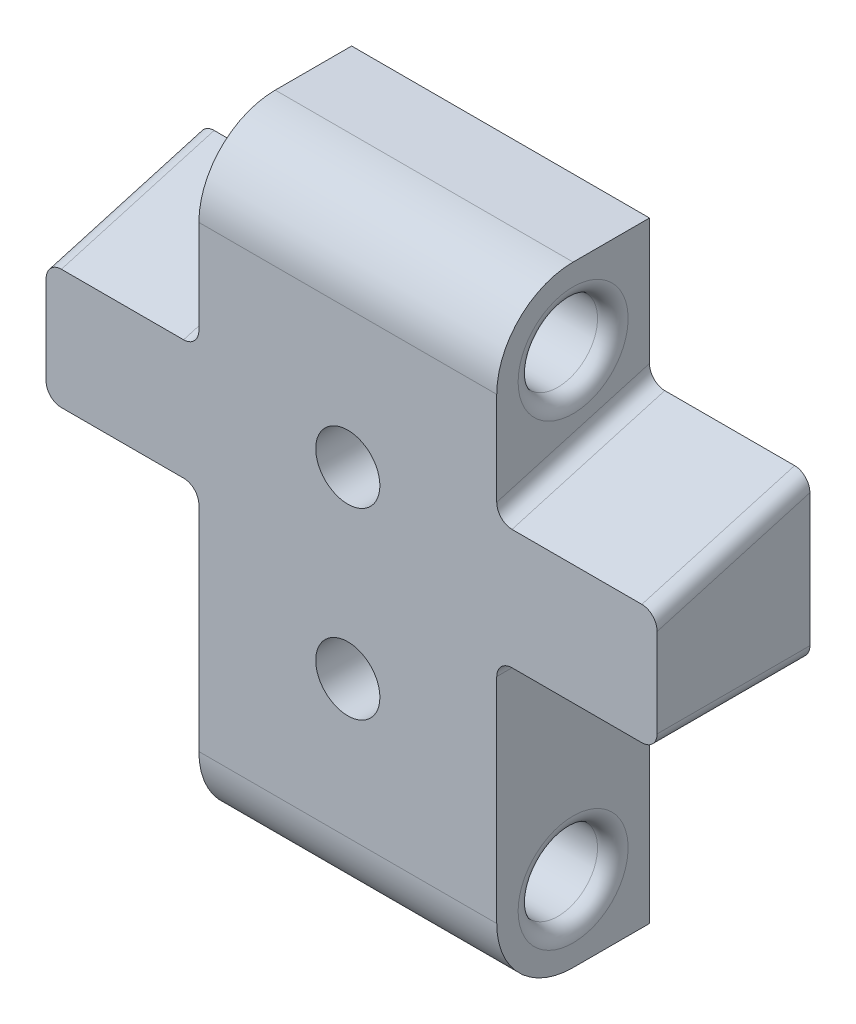
ISO-10303-21;
HEADER;
FILE_DESCRIPTION(('STEP AP214'),'2;1');
FILE_NAME('part.step','',(''),(''),'','','');
FILE_SCHEMA(('AUTOMOTIVE_DESIGN { 1 0 10303 214 1 1 1 1 }'));
ENDSEC;
DATA;
#1=APPLICATION_CONTEXT('core data for automotive mechanical design processes');
#2=APPLICATION_PROTOCOL_DEFINITION('international standard','automotive_design',2000,#1);
#3=PRODUCT_CONTEXT('',#1,'mechanical');
#4=PRODUCT('Part','Part','',(#3));
#5=PRODUCT_RELATED_PRODUCT_CATEGORY('part','',(#4));
#6=PRODUCT_DEFINITION_FORMATION('','',#4);
#7=PRODUCT_DEFINITION_CONTEXT('part definition',#1,'design');
#8=PRODUCT_DEFINITION('design','',#6,#7);
#9=PRODUCT_DEFINITION_SHAPE('','',#8);
#10=(LENGTH_UNIT() NAMED_UNIT(*) SI_UNIT(.MILLI.,.METRE.));
#11=(NAMED_UNIT(*) PLANE_ANGLE_UNIT() SI_UNIT($,.RADIAN.));
#12=(NAMED_UNIT(*) SI_UNIT($,.STERADIAN.) SOLID_ANGLE_UNIT());
#13=UNCERTAINTY_MEASURE_WITH_UNIT(LENGTH_MEASURE(1.E-05),#10,'distance_accuracy_value','');
#14=(GEOMETRIC_REPRESENTATION_CONTEXT(3) GLOBAL_UNCERTAINTY_ASSIGNED_CONTEXT((#13)) GLOBAL_UNIT_ASSIGNED_CONTEXT((#10,
#11,#12)) REPRESENTATION_CONTEXT('',''));
#15=CARTESIAN_POINT('',(0.,0.,0.));
#16=DIRECTION('',(0.,0.,1.));
#17=DIRECTION('',(1.,0.,0.));
#18=AXIS2_PLACEMENT_3D('',#15,#16,#17);
#19=CARTESIAN_POINT('',(-120.5,0.,0.));
#20=DIRECTION('',(-1.,0.,0.));
#21=DIRECTION('',(0.,0.,1.));
#22=AXIS2_PLACEMENT_3D('',#19,#20,#21);
#23=PLANE('',#22);
#24=CARTESIAN_POINT('',(-120.5,18.5,50.));
#25=DIRECTION('',(-1.,0.,0.));
#26=DIRECTION('',(0.,0.,1.));
#27=AXIS2_PLACEMENT_3D('',#24,#25,#26);
#28=CIRCLE('',#27,3.6);
#29=CARTESIAN_POINT('',(-120.5,18.5,53.6));
#30=VERTEX_POINT('',#29);
#31=EDGE_CURVE('E256',#30,#30,#28,.T.);
#32=ORIENTED_EDGE('',*,*,#31,.T.);
#33=EDGE_LOOP('',(#32));
#34=FACE_BOUND('',#33,.T.);
#35=DIRECTION('',(0.,-1.,0.));
#36=VECTOR('',#35,1.);
#37=CARTESIAN_POINT('',(-120.5,0.,45.));
#38=LINE('',#37,#36);
#39=CARTESIAN_POINT('',(-120.5,32.5,45.));
#40=VERTEX_POINT('',#39);
#41=CARTESIAN_POINT('',(-120.5,13.5,45.));
#42=VERTEX_POINT('',#41);
#43=EDGE_CURVE('E211',#40,#42,#38,.T.);
#44=ORIENTED_EDGE('',*,*,#43,.F.);
#45=DIRECTION('',(0.,0.,-1.));
#46=VECTOR('',#45,1.);
#47=CARTESIAN_POINT('',(-120.5,32.5,55.));
#48=LINE('',#47,#46);
#49=CARTESIAN_POINT('',(-120.5,32.5,55.));
#50=VERTEX_POINT('',#49);
#51=EDGE_CURVE('E259',#40,#50,#48,.F.);
#52=ORIENTED_EDGE('',*,*,#51,.T.);
#53=DIRECTION('',(0.,-1.,0.));
#54=VECTOR('',#53,1.);
#55=CARTESIAN_POINT('',(-120.5,0.,55.));
#56=LINE('',#55,#54);
#57=CARTESIAN_POINT('',(-120.5,18.5,55.));
#58=VERTEX_POINT('',#57);
#59=EDGE_CURVE('E203',#50,#58,#56,.T.);
#60=ORIENTED_EDGE('',*,*,#59,.T.);
#61=CARTESIAN_POINT('',(-120.5,18.5,50.));
#62=DIRECTION('',(-1.,0.,0.));
#63=DIRECTION('',(0.,0.,1.));
#64=AXIS2_PLACEMENT_3D('',#61,#62,#63);
#65=CIRCLE('',#64,5.);
#66=CARTESIAN_POINT('',(-120.5,13.5,50.));
#67=VERTEX_POINT('',#66);
#68=EDGE_CURVE('E193',#67,#58,#65,.T.);
#69=ORIENTED_EDGE('',*,*,#68,.F.);
#70=DIRECTION('',(0.,0.,1.));
#71=VECTOR('',#70,1.);
#72=CARTESIAN_POINT('',(-120.5,13.5,0.));
#73=LINE('',#72,#71);
#74=EDGE_CURVE('E218',#42,#67,#73,.T.);
#75=ORIENTED_EDGE('',*,*,#74,.F.);
#76=EDGE_LOOP('',(#44,#52,#60,#69,#75));
#77=FACE_BOUND('',#76,.T.);
#78=ADVANCED_FACE('F34',(#34,#77),#23,.F.);
#79=CARTESIAN_POINT('',(-120.5,48.5,50.));
#80=DIRECTION('',(-1.,0.,0.));
#81=DIRECTION('',(0.,0.,1.));
#82=AXIS2_PLACEMENT_3D('',#79,#80,#81);
#83=CIRCLE('',#82,3.6);
#84=CARTESIAN_POINT('',(-120.5,48.5,53.6));
#85=VERTEX_POINT('',#84);
#86=EDGE_CURVE('E293',#85,#85,#83,.T.);
#87=ORIENTED_EDGE('',*,*,#86,.T.);
#88=EDGE_LOOP('',(#87));
#89=FACE_BOUND('',#88,.T.);
#90=CARTESIAN_POINT('',(-120.5,48.5,55.));
#91=VERTEX_POINT('',#90);
#92=CARTESIAN_POINT('',(-120.5,42.3849256098288,55.));
#93=VERTEX_POINT('',#92);
#94=EDGE_CURVE('E196',#91,#93,#56,.T.);
#95=ORIENTED_EDGE('',*,*,#94,.T.);
#96=DIRECTION('',(0.,-0.275637355817,0.961261695938319));
#97=VECTOR('',#96,1.);
#98=CARTESIAN_POINT('',(-120.5,45.1733417274936,45.275637355817));
#99=LINE('',#98,#97);
#100=CARTESIAN_POINT('',(-120.5,45.2523794674169,45.));
#101=VERTEX_POINT('',#100);
#102=EDGE_CURVE('E296',#93,#101,#99,.F.);
#103=ORIENTED_EDGE('',*,*,#102,.T.);
#104=CARTESIAN_POINT('',(-120.5,53.5,45.));
#105=VERTEX_POINT('',#104);
#106=EDGE_CURVE('E215',#105,#101,#38,.T.);
#107=ORIENTED_EDGE('',*,*,#106,.F.);
#108=DIRECTION('',(0.,0.,1.));
#109=VECTOR('',#108,1.);
#110=CARTESIAN_POINT('',(-120.5,53.5,0.));
#111=LINE('',#110,#109);
#112=CARTESIAN_POINT('',(-120.5,53.5,50.));
#113=VERTEX_POINT('',#112);
#114=EDGE_CURVE('E208',#105,#113,#111,.T.);
#115=ORIENTED_EDGE('',*,*,#114,.T.);
#116=CARTESIAN_POINT('',(-120.5,48.5,50.));
#117=DIRECTION('',(-1.,0.,0.));
#118=DIRECTION('',(0.,0.,1.));
#119=AXIS2_PLACEMENT_3D('',#116,#117,#118);
#120=CIRCLE('',#119,5.);
#121=EDGE_CURVE('E187',#91,#113,#120,.T.);
#122=ORIENTED_EDGE('',*,*,#121,.F.);
#123=EDGE_LOOP('',(#95,#103,#107,#115,#122));
#124=FACE_BOUND('',#123,.T.);
#125=ADVANCED_FACE('F205',(#89,#124),#23,.F.);
#126=CARTESIAN_POINT('',(-140.,0.,0.));
#127=DIRECTION('',(-1.,0.,0.));
#128=DIRECTION('',(0.,0.,1.));
#129=AXIS2_PLACEMENT_3D('',#126,#127,#128);
#130=PLANE('',#129);
#131=CARTESIAN_POINT('',(-140.,18.5,50.));
#132=DIRECTION('',(-1.,0.,0.));
#133=DIRECTION('',(0.,0.,1.));
#134=AXIS2_PLACEMENT_3D('',#131,#132,#133);
#135=CIRCLE('',#134,3.6);
#136=CARTESIAN_POINT('',(-140.,18.5,53.6));
#137=VERTEX_POINT('',#136);
#138=EDGE_CURVE('E313',#137,#137,#135,.F.);
#139=ORIENTED_EDGE('',*,*,#138,.T.);
#140=EDGE_LOOP('',(#139));
#141=FACE_BOUND('',#140,.T.);
#142=DIRECTION('',(0.,-1.,0.));
#143=VECTOR('',#142,1.);
#144=CARTESIAN_POINT('',(-140.,0.,55.));
#145=LINE('',#144,#143);
#146=CARTESIAN_POINT('',(-140.,32.5,55.));
#147=VERTEX_POINT('',#146);
#148=CARTESIAN_POINT('',(-140.,18.5,55.));
#149=VERTEX_POINT('',#148);
#150=EDGE_CURVE('E225',#147,#149,#145,.T.);
#151=ORIENTED_EDGE('',*,*,#150,.F.);
#152=DIRECTION('',(0.,0.,-1.));
#153=VECTOR('',#152,1.);
#154=CARTESIAN_POINT('',(-140.,32.5,0.));
#155=LINE('',#154,#153);
#156=CARTESIAN_POINT('',(-140.,32.5,45.));
#157=VERTEX_POINT('',#156);
#158=EDGE_CURVE('E310',#147,#157,#155,.T.);
#159=ORIENTED_EDGE('',*,*,#158,.T.);
#160=DIRECTION('',(0.,-1.,0.));
#161=VECTOR('',#160,1.);
#162=CARTESIAN_POINT('',(-140.,0.,45.));
#163=LINE('',#162,#161);
#164=CARTESIAN_POINT('',(-140.,13.5,45.));
#165=VERTEX_POINT('',#164);
#166=EDGE_CURVE('E230',#157,#165,#163,.T.);
#167=ORIENTED_EDGE('',*,*,#166,.T.);
#168=DIRECTION('',(0.,0.,1.));
#169=VECTOR('',#168,1.);
#170=CARTESIAN_POINT('',(-140.,13.5,0.));
#171=LINE('',#170,#169);
#172=CARTESIAN_POINT('',(-140.,13.5,50.));
#173=VERTEX_POINT('',#172);
#174=EDGE_CURVE('E234',#165,#173,#171,.T.);
#175=ORIENTED_EDGE('',*,*,#174,.T.);
#176=CARTESIAN_POINT('',(-140.,18.5,50.));
#177=DIRECTION('',(-1.,0.,0.));
#178=DIRECTION('',(0.,0.,1.));
#179=AXIS2_PLACEMENT_3D('',#176,#177,#178);
#180=CIRCLE('',#179,5.);
#181=EDGE_CURVE('E237',#173,#149,#180,.T.);
#182=ORIENTED_EDGE('',*,*,#181,.T.);
#183=EDGE_LOOP('',(#151,#159,#167,#175,#182));
#184=FACE_BOUND('',#183,.T.);
#185=ADVANCED_FACE('F405',(#141,#184),#130,.T.);
#186=CARTESIAN_POINT('',(-140.,48.5,50.));
#187=DIRECTION('',(-1.,0.,0.));
#188=DIRECTION('',(0.,0.,1.));
#189=AXIS2_PLACEMENT_3D('',#186,#187,#188);
#190=CIRCLE('',#189,3.6);
#191=CARTESIAN_POINT('',(-140.,48.5,53.6));
#192=VERTEX_POINT('',#191);
#193=EDGE_CURVE('E307',#192,#192,#190,.F.);
#194=ORIENTED_EDGE('',*,*,#193,.T.);
#195=EDGE_LOOP('',(#194));
#196=FACE_BOUND('',#195,.T.);
#197=CARTESIAN_POINT('',(-140.,53.5,45.));
#198=VERTEX_POINT('',#197);
#199=CARTESIAN_POINT('',(-140.,45.2523794674169,45.));
#200=VERTEX_POINT('',#199);
#201=EDGE_CURVE('E231',#198,#200,#163,.T.);
#202=ORIENTED_EDGE('',*,*,#201,.T.);
#203=DIRECTION('',(0.,-0.275637355817,0.961261695938319));
#204=VECTOR('',#203,1.);
#205=CARTESIAN_POINT('',(-140.,53.737470305901,15.4089716525681));
#206=LINE('',#205,#204);
#207=CARTESIAN_POINT('',(-140.,42.3849256098288,55.));
#208=VERTEX_POINT('',#207);
#209=EDGE_CURVE('E304',#200,#208,#206,.T.);
#210=ORIENTED_EDGE('',*,*,#209,.T.);
#211=CARTESIAN_POINT('',(-140.,48.5,55.));
#212=VERTEX_POINT('',#211);
#213=EDGE_CURVE('E223',#212,#208,#145,.T.);
#214=ORIENTED_EDGE('',*,*,#213,.F.);
#215=CARTESIAN_POINT('',(-140.,48.5,50.));
#216=DIRECTION('',(-1.,0.,0.));
#217=DIRECTION('',(0.,0.,1.));
#218=AXIS2_PLACEMENT_3D('',#215,#216,#217);
#219=CIRCLE('',#218,5.);
#220=CARTESIAN_POINT('',(-140.,53.5,50.));
#221=VERTEX_POINT('',#220);
#222=EDGE_CURVE('E189',#212,#221,#219,.T.);
#223=ORIENTED_EDGE('',*,*,#222,.T.);
#224=DIRECTION('',(0.,0.,1.));
#225=VECTOR('',#224,1.);
#226=CARTESIAN_POINT('',(-140.,53.5,0.));
#227=LINE('',#226,#225);
#228=EDGE_CURVE('E227',#198,#221,#227,.T.);
#229=ORIENTED_EDGE('',*,*,#228,.F.);
#230=EDGE_LOOP('',(#202,#210,#214,#223,#229));
#231=FACE_BOUND('',#230,.T.);
#232=ADVANCED_FACE('F362',(#196,#231),#130,.T.);
#233=CARTESIAN_POINT('',(-120.5,0.,55.));
#234=DIRECTION('',(0.,0.,-1.));
#235=DIRECTION('',(-1.,0.,0.));
#236=AXIS2_PLACEMENT_3D('',#233,#234,#235);
#237=PLANE('',#236);
#238=CARTESIAN_POINT('',(-130.25,27.5,55.));
#239=DIRECTION('',(0.,0.,1.));
#240=DIRECTION('',(1.,0.,0.));
#241=AXIS2_PLACEMENT_3D('',#238,#239,#240);
#242=CIRCLE('',#241,2.09999999999999);
#243=CARTESIAN_POINT('',(-128.15,27.5,55.));
#244=VERTEX_POINT('',#243);
#245=EDGE_CURVE('E539',#244,#244,#242,.T.);
#246=ORIENTED_EDGE('',*,*,#245,.F.);
#247=EDGE_LOOP('',(#246));
#248=FACE_BOUND('',#247,.T.);
#249=CARTESIAN_POINT('',(-130.25,39.5,55.));
#250=DIRECTION('',(0.,0.,1.));
#251=DIRECTION('',(1.,0.,0.));
#252=AXIS2_PLACEMENT_3D('',#249,#250,#251);
#253=CIRCLE('',#252,2.10000000000002);
#254=CARTESIAN_POINT('',(-128.15,39.5,55.));
#255=VERTEX_POINT('',#254);
#256=EDGE_CURVE('E533',#255,#255,#253,.T.);
#257=ORIENTED_EDGE('',*,*,#256,.F.);
#258=EDGE_LOOP('',(#257));
#259=FACE_BOUND('',#258,.T.);
#260=DIRECTION('',(-1.,0.,0.));
#261=VECTOR('',#260,1.);
#262=CARTESIAN_POINT('',(-110.,33.5,55.));
#263=LINE('',#262,#261);
#264=CARTESIAN_POINT('',(-111.,33.5,55.));
#265=VERTEX_POINT('',#264);
#266=CARTESIAN_POINT('',(-119.5,33.5,55.));
#267=VERTEX_POINT('',#266);
#268=EDGE_CURVE('E351',#265,#267,#263,.T.);
#269=ORIENTED_EDGE('',*,*,#268,.F.);
#270=CARTESIAN_POINT('',(-111.,34.5,55.));
#271=DIRECTION('',(0.,0.,-1.));
#272=DIRECTION('',(-1.,0.,0.));
#273=AXIS2_PLACEMENT_3D('',#270,#271,#272);
#274=CIRCLE('',#273,1.);
#275=CARTESIAN_POINT('',(-110.,34.5,55.));
#276=VERTEX_POINT('',#275);
#277=EDGE_CURVE('E286',#265,#276,#274,.F.);
#278=ORIENTED_EDGE('',*,*,#277,.T.);
#279=DIRECTION('',(0.,-1.,0.));
#280=VECTOR('',#279,1.);
#281=CARTESIAN_POINT('',(-110.,0.,55.));
#282=LINE('',#281,#280);
#283=CARTESIAN_POINT('',(-110.,40.3043267381056,55.));
#284=VERTEX_POINT('',#283);
#285=EDGE_CURVE('E384',#284,#276,#282,.T.);
#286=ORIENTED_EDGE('',*,*,#285,.F.);
#287=CARTESIAN_POINT('',(-111.,40.3043267381056,55.));
#288=DIRECTION('',(0.,0.,-1.));
#289=DIRECTION('',(0.,-1.,0.));
#290=AXIS2_PLACEMENT_3D('',#287,#288,#289);
#291=ELLIPSE('',#290,1.0402994358616,1.);
#292=CARTESIAN_POINT('',(-111.,41.3446261739672,55.));
#293=VERTEX_POINT('',#292);
#294=EDGE_CURVE('E284',#284,#293,#291,.F.);
#295=ORIENTED_EDGE('',*,*,#294,.T.);
#296=DIRECTION('',(-1.,0.,0.));
#297=VECTOR('',#296,1.);
#298=CARTESIAN_POINT('',(-110.,41.3446261739672,55.));
#299=LINE('',#298,#297);
#300=CARTESIAN_POINT('',(-119.5,41.3446261739672,55.));
#301=VERTEX_POINT('',#300);
#302=EDGE_CURVE('E350',#293,#301,#299,.T.);
#303=ORIENTED_EDGE('',*,*,#302,.T.);
#304=CARTESIAN_POINT('',(-119.5,42.3849256098288,55.));
#305=DIRECTION('',(0.,0.,-1.));
#306=DIRECTION('',(0.,1.,0.));
#307=AXIS2_PLACEMENT_3D('',#304,#305,#306);
#308=ELLIPSE('',#307,1.0402994358616,1.);
#309=EDGE_CURVE('E200',#301,#93,#308,.T.);
#310=ORIENTED_EDGE('',*,*,#309,.T.);
#311=ORIENTED_EDGE('',*,*,#94,.F.);
#312=DIRECTION('',(-1.,0.,0.));
#313=VECTOR('',#312,1.);
#314=CARTESIAN_POINT('',(-120.5,48.5,55.));
#315=LINE('',#314,#313);
#316=EDGE_CURVE('E183',#91,#212,#315,.T.);
#317=ORIENTED_EDGE('',*,*,#316,.T.);
#318=ORIENTED_EDGE('',*,*,#213,.T.);
#319=CARTESIAN_POINT('',(-141.,42.3849256098288,55.));
#320=DIRECTION('',(0.,0.,-1.));
#321=DIRECTION('',(0.,-1.,0.));
#322=AXIS2_PLACEMENT_3D('',#319,#320,#321);
#323=ELLIPSE('',#322,1.0402994358616,1.);
#324=CARTESIAN_POINT('',(-141.,41.3446261739672,55.));
#325=VERTEX_POINT('',#324);
#326=EDGE_CURVE('E42',#208,#325,#323,.T.);
#327=ORIENTED_EDGE('',*,*,#326,.T.);
#328=CARTESIAN_POINT('',(-149.,41.3446261739672,55.));
#329=VERTEX_POINT('',#328);
#330=EDGE_CURVE('E341',#325,#329,#299,.T.);
#331=ORIENTED_EDGE('',*,*,#330,.T.);
#332=CARTESIAN_POINT('',(-149.,40.3043267381056,55.));
#333=DIRECTION('',(0.,0.,-1.));
#334=DIRECTION('',(0.,1.,0.));
#335=AXIS2_PLACEMENT_3D('',#332,#333,#334);
#336=ELLIPSE('',#335,1.0402994358616,1.);
#337=CARTESIAN_POINT('',(-150.,40.3043267381056,55.));
#338=VERTEX_POINT('',#337);
#339=EDGE_CURVE('E281',#329,#338,#336,.F.);
#340=ORIENTED_EDGE('',*,*,#339,.T.);
#341=DIRECTION('',(0.,-1.,0.));
#342=VECTOR('',#341,1.);
#343=CARTESIAN_POINT('',(-150.,0.,55.));
#344=LINE('',#343,#342);
#345=CARTESIAN_POINT('',(-150.,34.5,55.));
#346=VERTEX_POINT('',#345);
#347=EDGE_CURVE('E529',#338,#346,#344,.T.);
#348=ORIENTED_EDGE('',*,*,#347,.T.);
#349=CARTESIAN_POINT('',(-149.,34.5,55.));
#350=DIRECTION('',(0.,0.,-1.));
#351=DIRECTION('',(-1.,0.,0.));
#352=AXIS2_PLACEMENT_3D('',#349,#350,#351);
#353=CIRCLE('',#352,1.);
#354=CARTESIAN_POINT('',(-149.,33.5,55.));
#355=VERTEX_POINT('',#354);
#356=EDGE_CURVE('E55',#346,#355,#353,.F.);
#357=ORIENTED_EDGE('',*,*,#356,.T.);
#358=CARTESIAN_POINT('',(-141.,33.5,55.));
#359=VERTEX_POINT('',#358);
#360=EDGE_CURVE('E379',#359,#355,#263,.T.);
#361=ORIENTED_EDGE('',*,*,#360,.F.);
#362=CARTESIAN_POINT('',(-141.,32.5,55.));
#363=DIRECTION('',(0.,0.,-1.));
#364=DIRECTION('',(-1.,0.,0.));
#365=AXIS2_PLACEMENT_3D('',#362,#363,#364);
#366=CIRCLE('',#365,1.);
#367=EDGE_CURVE('E49',#359,#147,#366,.T.);
#368=ORIENTED_EDGE('',*,*,#367,.T.);
#369=ORIENTED_EDGE('',*,*,#150,.T.);
#370=DIRECTION('',(-1.,0.,0.));
#371=VECTOR('',#370,1.);
#372=CARTESIAN_POINT('',(-120.5,18.5,55.));
#373=LINE('',#372,#371);
#374=EDGE_CURVE('E240',#58,#149,#373,.T.);
#375=ORIENTED_EDGE('',*,*,#374,.F.);
#376=ORIENTED_EDGE('',*,*,#59,.F.);
#377=CARTESIAN_POINT('',(-119.5,32.5,55.));
#378=DIRECTION('',(0.,0.,-1.));
#379=DIRECTION('',(-1.,0.,0.));
#380=AXIS2_PLACEMENT_3D('',#377,#378,#379);
#381=CIRCLE('',#380,1.);
#382=EDGE_CURVE('E332',#50,#267,#381,.T.);
#383=ORIENTED_EDGE('',*,*,#382,.T.);
#384=EDGE_LOOP('',(#269,#278,#286,#295,#303,#310,#311,#317,#318,#327,#331,#340,#348,#357,#361,
#368,#369,#375,#376,#383));
#385=FACE_BOUND('',#384,.T.);
#386=ADVANCED_FACE('F198',(#248,#259,#385),#237,.F.);
#387=CARTESIAN_POINT('',(-120.5,18.5,50.));
#388=DIRECTION('',(-1.,0.,0.));
#389=DIRECTION('',(0.,0.,1.));
#390=AXIS2_PLACEMENT_3D('',#387,#388,#389);
#391=CYLINDRICAL_SURFACE('',#390,5.);
#392=ORIENTED_EDGE('',*,*,#181,.F.);
#393=DIRECTION('',(-1.,0.,0.));
#394=VECTOR('',#393,1.);
#395=CARTESIAN_POINT('',(-120.5,13.5,50.));
#396=LINE('',#395,#394);
#397=EDGE_CURVE('E244',#67,#173,#396,.T.);
#398=ORIENTED_EDGE('',*,*,#397,.F.);
#399=ORIENTED_EDGE('',*,*,#68,.T.);
#400=ORIENTED_EDGE('',*,*,#374,.T.);
#401=EDGE_LOOP('',(#392,#398,#399,#400));
#402=FACE_BOUND('',#401,.T.);
#403=ADVANCED_FACE('F403',(#402),#391,.T.);
#404=CARTESIAN_POINT('',(-120.5,13.5,0.));
#405=DIRECTION('',(0.,-1.,0.));
#406=DIRECTION('',(0.,0.,-1.));
#407=AXIS2_PLACEMENT_3D('',#404,#405,#406);
#408=PLANE('',#407);
#409=ORIENTED_EDGE('',*,*,#174,.F.);
#410=DIRECTION('',(-1.,0.,0.));
#411=VECTOR('',#410,1.);
#412=CARTESIAN_POINT('',(-120.5,13.5,45.));
#413=LINE('',#412,#411);
#414=EDGE_CURVE('E246',#42,#165,#413,.T.);
#415=ORIENTED_EDGE('',*,*,#414,.F.);
#416=ORIENTED_EDGE('',*,*,#74,.T.);
#417=ORIENTED_EDGE('',*,*,#397,.T.);
#418=EDGE_LOOP('',(#409,#415,#416,#417));
#419=FACE_BOUND('',#418,.T.);
#420=ADVANCED_FACE('F410',(#419),#408,.T.);
#421=CARTESIAN_POINT('',(-120.5,0.,45.));
#422=DIRECTION('',(0.,0.,-1.));
#423=DIRECTION('',(-1.,0.,0.));
#424=AXIS2_PLACEMENT_3D('',#421,#422,#423);
#425=PLANE('',#424);
#426=CARTESIAN_POINT('',(-130.25,27.5,45.));
#427=DIRECTION('',(0.,0.,1.));
#428=DIRECTION('',(1.,0.,0.));
#429=AXIS2_PLACEMENT_3D('',#426,#427,#428);
#430=CIRCLE('',#429,2.09999999999999);
#431=CARTESIAN_POINT('',(-128.15,27.5,45.));
#432=VERTEX_POINT('',#431);
#433=EDGE_CURVE('E536',#432,#432,#430,.T.);
#434=ORIENTED_EDGE('',*,*,#433,.T.);
#435=EDGE_LOOP('',(#434));
#436=FACE_BOUND('',#435,.T.);
#437=CARTESIAN_POINT('',(-130.25,39.5,45.));
#438=DIRECTION('',(0.,0.,1.));
#439=DIRECTION('',(1.,0.,0.));
#440=AXIS2_PLACEMENT_3D('',#437,#438,#439);
#441=CIRCLE('',#440,2.10000000000002);
#442=CARTESIAN_POINT('',(-128.15,39.5,45.));
#443=VERTEX_POINT('',#442);
#444=EDGE_CURVE('E530',#443,#443,#441,.T.);
#445=ORIENTED_EDGE('',*,*,#444,.T.);
#446=EDGE_LOOP('',(#445));
#447=FACE_BOUND('',#446,.T.);
#448=DIRECTION('',(0.,-1.,0.));
#449=VECTOR('',#448,1.);
#450=CARTESIAN_POINT('',(-110.,0.,45.));
#451=LINE('',#450,#449);
#452=CARTESIAN_POINT('',(-110.,43.1717805956937,45.));
#453=VERTEX_POINT('',#452);
#454=CARTESIAN_POINT('',(-110.,34.5,45.));
#455=VERTEX_POINT('',#454);
#456=EDGE_CURVE('E380',#453,#455,#451,.T.);
#457=ORIENTED_EDGE('',*,*,#456,.T.);
#458=CARTESIAN_POINT('',(-111.,34.5,45.));
#459=DIRECTION('',(0.,0.,-1.));
#460=DIRECTION('',(-1.,0.,0.));
#461=AXIS2_PLACEMENT_3D('',#458,#459,#460);
#462=CIRCLE('',#461,1.);
#463=CARTESIAN_POINT('',(-111.,33.5,45.));
#464=VERTEX_POINT('',#463);
#465=EDGE_CURVE('E279',#455,#464,#462,.T.);
#466=ORIENTED_EDGE('',*,*,#465,.T.);
#467=DIRECTION('',(-1.,0.,0.));
#468=VECTOR('',#467,1.);
#469=CARTESIAN_POINT('',(-110.,33.5,45.));
#470=LINE('',#469,#468);
#471=CARTESIAN_POINT('',(-119.5,33.5,45.));
#472=VERTEX_POINT('',#471);
#473=EDGE_CURVE('E393',#464,#472,#470,.T.);
#474=ORIENTED_EDGE('',*,*,#473,.T.);
#475=CARTESIAN_POINT('',(-119.5,32.5,45.));
#476=DIRECTION('',(0.,0.,-1.));
#477=DIRECTION('',(-1.,0.,0.));
#478=AXIS2_PLACEMENT_3D('',#475,#476,#477);
#479=CIRCLE('',#478,1.);
#480=EDGE_CURVE('E330',#472,#40,#479,.F.);
#481=ORIENTED_EDGE('',*,*,#480,.T.);
#482=ORIENTED_EDGE('',*,*,#43,.T.);
#483=ORIENTED_EDGE('',*,*,#414,.T.);
#484=ORIENTED_EDGE('',*,*,#166,.F.);
#485=CARTESIAN_POINT('',(-141.,32.5,45.));
#486=DIRECTION('',(0.,0.,-1.));
#487=DIRECTION('',(-1.,0.,0.));
#488=AXIS2_PLACEMENT_3D('',#485,#486,#487);
#489=CIRCLE('',#488,1.);
#490=CARTESIAN_POINT('',(-141.,33.5,45.));
#491=VERTEX_POINT('',#490);
#492=EDGE_CURVE('E337',#157,#491,#489,.F.);
#493=ORIENTED_EDGE('',*,*,#492,.T.);
#494=CARTESIAN_POINT('',(-149.,33.5,45.));
#495=VERTEX_POINT('',#494);
#496=EDGE_CURVE('E391',#491,#495,#470,.T.);
#497=ORIENTED_EDGE('',*,*,#496,.T.);
#498=CARTESIAN_POINT('',(-149.,34.5,45.));
#499=DIRECTION('',(0.,0.,-1.));
#500=DIRECTION('',(-1.,0.,0.));
#501=AXIS2_PLACEMENT_3D('',#498,#499,#500);
#502=CIRCLE('',#501,1.);
#503=CARTESIAN_POINT('',(-150.,34.5,45.));
#504=VERTEX_POINT('',#503);
#505=EDGE_CURVE('E275',#495,#504,#502,.T.);
#506=ORIENTED_EDGE('',*,*,#505,.T.);
#507=DIRECTION('',(0.,-1.,0.));
#508=VECTOR('',#507,1.);
#509=CARTESIAN_POINT('',(-150.,0.,45.));
#510=LINE('',#509,#508);
#511=CARTESIAN_POINT('',(-150.,43.1717805956937,45.));
#512=VERTEX_POINT('',#511);
#513=EDGE_CURVE('E388',#512,#504,#510,.T.);
#514=ORIENTED_EDGE('',*,*,#513,.F.);
#515=CARTESIAN_POINT('',(-149.,43.1717805956937,45.));
#516=DIRECTION('',(0.,0.,-1.));
#517=DIRECTION('',(0.,1.,0.));
#518=AXIS2_PLACEMENT_3D('',#515,#516,#517);
#519=ELLIPSE('',#518,1.0402994358616,1.);
#520=CARTESIAN_POINT('',(-149.,44.2120800315553,45.));
#521=VERTEX_POINT('',#520);
#522=EDGE_CURVE('E273',#512,#521,#519,.T.);
#523=ORIENTED_EDGE('',*,*,#522,.T.);
#524=DIRECTION('',(-1.,0.,0.));
#525=VECTOR('',#524,1.);
#526=CARTESIAN_POINT('',(-110.,44.2120800315553,45.));
#527=LINE('',#526,#525);
#528=CARTESIAN_POINT('',(-141.,44.2120800315553,45.));
#529=VERTEX_POINT('',#528);
#530=EDGE_CURVE('E359',#529,#521,#527,.T.);
#531=ORIENTED_EDGE('',*,*,#530,.F.);
#532=CARTESIAN_POINT('',(-141.,45.2523794674169,45.));
#533=DIRECTION('',(0.,0.,-1.));
#534=DIRECTION('',(0.,-1.,0.));
#535=AXIS2_PLACEMENT_3D('',#532,#533,#534);
#536=ELLIPSE('',#535,1.0402994358616,1.);
#537=EDGE_CURVE('E11',#529,#200,#536,.F.);
#538=ORIENTED_EDGE('',*,*,#537,.T.);
#539=ORIENTED_EDGE('',*,*,#201,.F.);
#540=DIRECTION('',(-1.,0.,0.));
#541=VECTOR('',#540,1.);
#542=CARTESIAN_POINT('',(-120.5,53.5,45.));
#543=LINE('',#542,#541);
#544=EDGE_CURVE('E249',#105,#198,#543,.T.);
#545=ORIENTED_EDGE('',*,*,#544,.F.);
#546=ORIENTED_EDGE('',*,*,#106,.T.);
#547=CARTESIAN_POINT('',(-119.5,45.2523794674169,45.));
#548=DIRECTION('',(0.,0.,-1.));
#549=DIRECTION('',(0.,1.,0.));
#550=AXIS2_PLACEMENT_3D('',#547,#548,#549);
#551=ELLIPSE('',#550,1.0402994358616,1.);
#552=CARTESIAN_POINT('',(-119.5,44.2120800315553,45.));
#553=VERTEX_POINT('',#552);
#554=EDGE_CURVE('E335',#101,#553,#551,.F.);
#555=ORIENTED_EDGE('',*,*,#554,.T.);
#556=CARTESIAN_POINT('',(-111.,44.2120800315553,45.));
#557=VERTEX_POINT('',#556);
#558=EDGE_CURVE('E375',#557,#553,#527,.T.);
#559=ORIENTED_EDGE('',*,*,#558,.F.);
#560=CARTESIAN_POINT('',(-111.,43.1717805956937,45.));
#561=DIRECTION('',(0.,0.,-1.));
#562=DIRECTION('',(0.,-1.,0.));
#563=AXIS2_PLACEMENT_3D('',#560,#561,#562);
#564=ELLIPSE('',#563,1.0402994358616,1.);
#565=EDGE_CURVE('E277',#557,#453,#564,.T.);
#566=ORIENTED_EDGE('',*,*,#565,.T.);
#567=EDGE_LOOP('',(#457,#466,#474,#481,#482,#483,#484,#493,#497,#506,#514,#523,#531,#538,#539,
#545,#546,#555,#559,#566));
#568=FACE_BOUND('',#567,.T.);
#569=ADVANCED_FACE('F358',(#436,#447,#568),#425,.T.);
#570=CARTESIAN_POINT('',(-120.5,53.5,0.));
#571=DIRECTION('',(0.,-1.,0.));
#572=DIRECTION('',(0.,0.,-1.));
#573=AXIS2_PLACEMENT_3D('',#570,#571,#572);
#574=PLANE('',#573);
#575=ORIENTED_EDGE('',*,*,#228,.T.);
#576=DIRECTION('',(-1.,0.,0.));
#577=VECTOR('',#576,1.);
#578=CARTESIAN_POINT('',(-120.5,53.5,50.));
#579=LINE('',#578,#577);
#580=EDGE_CURVE('E192',#113,#221,#579,.T.);
#581=ORIENTED_EDGE('',*,*,#580,.F.);
#582=ORIENTED_EDGE('',*,*,#114,.F.);
#583=ORIENTED_EDGE('',*,*,#544,.T.);
#584=EDGE_LOOP('',(#575,#581,#582,#583));
#585=FACE_BOUND('',#584,.T.);
#586=ADVANCED_FACE('F364',(#585),#574,.F.);
#587=CARTESIAN_POINT('',(-120.5,48.5,50.));
#588=DIRECTION('',(-1.,0.,0.));
#589=DIRECTION('',(0.,0.,1.));
#590=AXIS2_PLACEMENT_3D('',#587,#588,#589);
#591=CYLINDRICAL_SURFACE('',#590,5.);
#592=ORIENTED_EDGE('',*,*,#222,.F.);
#593=ORIENTED_EDGE('',*,*,#316,.F.);
#594=ORIENTED_EDGE('',*,*,#121,.T.);
#595=ORIENTED_EDGE('',*,*,#580,.T.);
#596=EDGE_LOOP('',(#592,#593,#594,#595));
#597=FACE_BOUND('',#596,.T.);
#598=ADVANCED_FACE('F185',(#597),#591,.T.);
#599=CARTESIAN_POINT('',(-120.5,48.5,50.));
#600=DIRECTION('',(-1.,0.,0.));
#601=DIRECTION('',(0.,0.,1.));
#602=AXIS2_PLACEMENT_3D('',#599,#600,#601);
#603=CYLINDRICAL_SURFACE('',#602,2.6);
#604=CARTESIAN_POINT('',(-121.5,48.5,50.));
#605=DIRECTION('',(-1.,0.,0.));
#606=DIRECTION('',(0.,0.,1.));
#607=AXIS2_PLACEMENT_3D('',#604,#605,#606);
#608=CIRCLE('',#607,2.6);
#609=CARTESIAN_POINT('',(-121.5,48.5,52.6));
#610=VERTEX_POINT('',#609);
#611=EDGE_CURVE('E301',#610,#610,#608,.F.);
#612=ORIENTED_EDGE('',*,*,#611,.T.);
#613=EDGE_LOOP('',(#612));
#614=FACE_BOUND('',#613,.T.);
#615=CARTESIAN_POINT('',(-139.,48.5,50.));
#616=DIRECTION('',(-1.,0.,0.));
#617=DIRECTION('',(0.,0.,1.));
#618=AXIS2_PLACEMENT_3D('',#615,#616,#617);
#619=CIRCLE('',#618,2.6);
#620=CARTESIAN_POINT('',(-139.,48.5,52.6));
#621=VERTEX_POINT('',#620);
#622=EDGE_CURVE('E298',#621,#621,#619,.T.);
#623=ORIENTED_EDGE('',*,*,#622,.T.);
#624=EDGE_LOOP('',(#623));
#625=FACE_BOUND('',#624,.T.);
#626=ADVANCED_FACE('F460',(#614,#625),#603,.F.);
#627=CARTESIAN_POINT('',(-120.5,18.5,50.));
#628=DIRECTION('',(-1.,0.,0.));
#629=DIRECTION('',(0.,0.,1.));
#630=AXIS2_PLACEMENT_3D('',#627,#628,#629);
#631=CYLINDRICAL_SURFACE('',#630,2.6);
#632=CARTESIAN_POINT('',(-121.5,18.5,50.));
#633=DIRECTION('',(-1.,0.,0.));
#634=DIRECTION('',(0.,0.,1.));
#635=AXIS2_PLACEMENT_3D('',#632,#633,#634);
#636=CIRCLE('',#635,2.6);
#637=CARTESIAN_POINT('',(-121.5,18.5,52.6));
#638=VERTEX_POINT('',#637);
#639=EDGE_CURVE('E264',#638,#638,#636,.F.);
#640=ORIENTED_EDGE('',*,*,#639,.T.);
#641=EDGE_LOOP('',(#640));
#642=FACE_BOUND('',#641,.T.);
#643=CARTESIAN_POINT('',(-139.,18.5,50.));
#644=DIRECTION('',(-1.,0.,0.));
#645=DIRECTION('',(0.,0.,1.));
#646=AXIS2_PLACEMENT_3D('',#643,#644,#645);
#647=CIRCLE('',#646,2.6);
#648=CARTESIAN_POINT('',(-139.,18.5,52.6));
#649=VERTEX_POINT('',#648);
#650=EDGE_CURVE('E261',#649,#649,#647,.T.);
#651=ORIENTED_EDGE('',*,*,#650,.T.);
#652=EDGE_LOOP('',(#651));
#653=FACE_BOUND('',#652,.T.);
#654=ADVANCED_FACE('F456',(#642,#653),#631,.F.);
#655=CARTESIAN_POINT('',(-150.,0.,0.));
#656=DIRECTION('',(-1.,0.,0.));
#657=DIRECTION('',(0.,0.,1.));
#658=AXIS2_PLACEMENT_3D('',#655,#656,#657);
#659=PLANE('',#658);
#660=ORIENTED_EDGE('',*,*,#513,.T.);
#661=DIRECTION('',(0.,0.,-1.));
#662=VECTOR('',#661,1.);
#663=CARTESIAN_POINT('',(-150.,34.5,55.));
#664=LINE('',#663,#662);
#665=EDGE_CURVE('E323',#504,#346,#664,.F.);
#666=ORIENTED_EDGE('',*,*,#665,.T.);
#667=ORIENTED_EDGE('',*,*,#347,.F.);
#668=DIRECTION('',(0.,-0.275637355817,0.961261695938319));
#669=VECTOR('',#668,1.);
#670=CARTESIAN_POINT('',(-150.,43.2508183356169,44.724362644183));
#671=LINE('',#670,#669);
#672=EDGE_CURVE('E321',#338,#512,#671,.F.);
#673=ORIENTED_EDGE('',*,*,#672,.T.);
#674=EDGE_LOOP('',(#660,#666,#667,#673));
#675=FACE_BOUND('',#674,.T.);
#676=ADVANCED_FACE('F459',(#675),#659,.T.);
#677=CARTESIAN_POINT('',(-110.,52.7762086099627,15.1333342967511));
#678=DIRECTION('',(0.,-0.961261695938319,-0.275637355817));
#679=DIRECTION('',(0.,0.275637355817,-0.961261695938319));
#680=AXIS2_PLACEMENT_3D('',#677,#678,#679);
#681=PLANE('',#680);
#682=ORIENTED_EDGE('',*,*,#330,.F.);
#683=DIRECTION('',(0.,-0.275637355817,0.961261695938319));
#684=VECTOR('',#683,1.);
#685=CARTESIAN_POINT('',(-141.,52.7762086099627,15.1333342967511));
#686=LINE('',#685,#684);
#687=EDGE_CURVE('E328',#325,#529,#686,.F.);
#688=ORIENTED_EDGE('',*,*,#687,.T.);
#689=ORIENTED_EDGE('',*,*,#530,.T.);
#690=DIRECTION('',(0.,-0.275637355817,0.961261695938319));
#691=VECTOR('',#690,1.);
#692=CARTESIAN_POINT('',(-149.,41.3446261739672,55.));
#693=LINE('',#692,#691);
#694=EDGE_CURVE('E325',#521,#329,#693,.T.);
#695=ORIENTED_EDGE('',*,*,#694,.T.);
#696=EDGE_LOOP('',(#682,#688,#689,#695));
#697=FACE_BOUND('',#696,.T.);
#698=ADVANCED_FACE('F346',(#697),#681,.F.);
#699=CARTESIAN_POINT('',(-110.,33.5,0.));
#700=DIRECTION('',(0.,1.,0.));
#701=DIRECTION('',(0.,0.,1.));
#702=AXIS2_PLACEMENT_3D('',#699,#700,#701);
#703=PLANE('',#702);
#704=ORIENTED_EDGE('',*,*,#496,.F.);
#705=DIRECTION('',(0.,0.,-1.));
#706=VECTOR('',#705,1.);
#707=CARTESIAN_POINT('',(-141.,33.5,0.));
#708=LINE('',#707,#706);
#709=EDGE_CURVE('E319',#491,#359,#708,.F.);
#710=ORIENTED_EDGE('',*,*,#709,.T.);
#711=ORIENTED_EDGE('',*,*,#360,.T.);
#712=DIRECTION('',(0.,0.,-1.));
#713=VECTOR('',#712,1.);
#714=CARTESIAN_POINT('',(-149.,33.5,45.));
#715=LINE('',#714,#713);
#716=EDGE_CURVE('E316',#355,#495,#715,.T.);
#717=ORIENTED_EDGE('',*,*,#716,.T.);
#718=EDGE_LOOP('',(#704,#710,#711,#717));
#719=FACE_BOUND('',#718,.T.);
#720=ADVANCED_FACE('F451',(#719),#703,.F.);
#721=ORIENTED_EDGE('',*,*,#268,.T.);
#722=DIRECTION('',(0.,0.,-1.));
#723=VECTOR('',#722,1.);
#724=CARTESIAN_POINT('',(-119.5,33.5,45.));
#725=LINE('',#724,#723);
#726=EDGE_CURVE('E253',#267,#472,#725,.T.);
#727=ORIENTED_EDGE('',*,*,#726,.T.);
#728=ORIENTED_EDGE('',*,*,#473,.F.);
#729=DIRECTION('',(0.,0.,-1.));
#730=VECTOR('',#729,1.);
#731=CARTESIAN_POINT('',(-111.,33.5,0.));
#732=LINE('',#731,#730);
#733=EDGE_CURVE('E243',#464,#265,#732,.F.);
#734=ORIENTED_EDGE('',*,*,#733,.T.);
#735=EDGE_LOOP('',(#721,#727,#728,#734));
#736=FACE_BOUND('',#735,.T.);
#737=ADVANCED_FACE('F420',(#736),#703,.F.);
#738=ORIENTED_EDGE('',*,*,#302,.F.);
#739=DIRECTION('',(0.,-0.275637355817,0.961261695938319));
#740=VECTOR('',#739,1.);
#741=CARTESIAN_POINT('',(-111.,52.7762086099627,15.1333342967511));
#742=LINE('',#741,#740);
#743=EDGE_CURVE('E291',#293,#557,#742,.F.);
#744=ORIENTED_EDGE('',*,*,#743,.T.);
#745=ORIENTED_EDGE('',*,*,#558,.T.);
#746=DIRECTION('',(0.,-0.275637355817,0.961261695938319));
#747=VECTOR('',#746,1.);
#748=CARTESIAN_POINT('',(-119.5,41.3446261739672,55.));
#749=LINE('',#748,#747);
#750=EDGE_CURVE('E288',#553,#301,#749,.T.);
#751=ORIENTED_EDGE('',*,*,#750,.T.);
#752=EDGE_LOOP('',(#738,#744,#745,#751));
#753=FACE_BOUND('',#752,.T.);
#754=ADVANCED_FACE('F373',(#753),#681,.F.);
#755=CARTESIAN_POINT('',(-110.,0.,0.));
#756=DIRECTION('',(-1.,0.,0.));
#757=DIRECTION('',(0.,0.,1.));
#758=AXIS2_PLACEMENT_3D('',#755,#756,#757);
#759=PLANE('',#758);
#760=ORIENTED_EDGE('',*,*,#285,.T.);
#761=DIRECTION('',(0.,0.,-1.));
#762=VECTOR('',#761,1.);
#763=CARTESIAN_POINT('',(-110.,34.5,0.));
#764=LINE('',#763,#762);
#765=EDGE_CURVE('E270',#276,#455,#764,.T.);
#766=ORIENTED_EDGE('',*,*,#765,.T.);
#767=ORIENTED_EDGE('',*,*,#456,.F.);
#768=DIRECTION('',(0.,-0.275637355817,0.961261695938319));
#769=VECTOR('',#768,1.);
#770=CARTESIAN_POINT('',(-110.,51.8149469140244,14.8576969409341));
#771=LINE('',#770,#769);
#772=EDGE_CURVE('E267',#453,#284,#771,.T.);
#773=ORIENTED_EDGE('',*,*,#772,.T.);
#774=EDGE_LOOP('',(#760,#766,#767,#773));
#775=FACE_BOUND('',#774,.T.);
#776=ADVANCED_FACE('F427',(#775),#759,.F.);
#777=CARTESIAN_POINT('',(-119.5,32.5,0.));
#778=DIRECTION('',(0.,0.,1.));
#779=DIRECTION('',(1.,0.,0.));
#780=AXIS2_PLACEMENT_3D('',#777,#778,#779);
#781=CYLINDRICAL_SURFACE('',#780,1.);
#782=ORIENTED_EDGE('',*,*,#382,.F.);
#783=ORIENTED_EDGE('',*,*,#51,.F.);
#784=ORIENTED_EDGE('',*,*,#480,.F.);
#785=ORIENTED_EDGE('',*,*,#726,.F.);
#786=EDGE_LOOP('',(#782,#783,#784,#785));
#787=FACE_BOUND('',#786,.T.);
#788=ADVANCED_FACE('F418',(#787),#781,.F.);
#789=CARTESIAN_POINT('',(-121.5,18.5,50.));
#790=DIRECTION('',(-1.,0.,0.));
#791=DIRECTION('',(0.,0.,1.));
#792=AXIS2_PLACEMENT_3D('',#789,#790,#791);
#793=TOROIDAL_SURFACE('',#792,3.6,1.);
#794=ORIENTED_EDGE('',*,*,#639,.F.);
#795=EDGE_LOOP('',(#794));
#796=FACE_BOUND('',#795,.T.);
#797=ORIENTED_EDGE('',*,*,#31,.F.);
#798=EDGE_LOOP('',(#797));
#799=FACE_BOUND('',#798,.T.);
#800=ADVANCED_FACE('F440',(#796,#799),#793,.T.);
#801=CARTESIAN_POINT('',(-111.,34.5,0.));
#802=DIRECTION('',(0.,0.,-1.));
#803=DIRECTION('',(-1.,0.,0.));
#804=AXIS2_PLACEMENT_3D('',#801,#802,#803);
#805=CYLINDRICAL_SURFACE('',#804,1.);
#806=ORIENTED_EDGE('',*,*,#277,.F.);
#807=ORIENTED_EDGE('',*,*,#733,.F.);
#808=ORIENTED_EDGE('',*,*,#465,.F.);
#809=ORIENTED_EDGE('',*,*,#765,.F.);
#810=EDGE_LOOP('',(#806,#807,#808,#809));
#811=FACE_BOUND('',#810,.T.);
#812=ADVANCED_FACE('F425',(#811),#805,.T.);
#813=CARTESIAN_POINT('',(-111.,51.8149469140244,14.8576969409341));
#814=DIRECTION('',(0.,-0.275637355817,0.961261695938319));
#815=DIRECTION('',(0.,-0.961261695938319,-0.275637355817));
#816=AXIS2_PLACEMENT_3D('',#813,#814,#815);
#817=CYLINDRICAL_SURFACE('',#816,1.);
#818=ORIENTED_EDGE('',*,*,#565,.F.);
#819=ORIENTED_EDGE('',*,*,#743,.F.);
#820=ORIENTED_EDGE('',*,*,#294,.F.);
#821=ORIENTED_EDGE('',*,*,#772,.F.);
#822=EDGE_LOOP('',(#818,#819,#820,#821));
#823=FACE_BOUND('',#822,.T.);
#824=ADVANCED_FACE('F431',(#823),#817,.T.);
#825=CARTESIAN_POINT('',(-119.5,53.7374703059011,15.4089716525681));
#826=DIRECTION('',(0.,0.275637355817,-0.961261695938319));
#827=DIRECTION('',(0.,0.961261695938319,0.275637355817));
#828=AXIS2_PLACEMENT_3D('',#825,#826,#827);
#829=CYLINDRICAL_SURFACE('',#828,1.);
#830=ORIENTED_EDGE('',*,*,#554,.F.);
#831=ORIENTED_EDGE('',*,*,#102,.F.);
#832=ORIENTED_EDGE('',*,*,#309,.F.);
#833=ORIENTED_EDGE('',*,*,#750,.F.);
#834=EDGE_LOOP('',(#830,#831,#832,#833));
#835=FACE_BOUND('',#834,.T.);
#836=ADVANCED_FACE('F370',(#835),#829,.F.);
#837=CARTESIAN_POINT('',(-121.5,48.5,50.));
#838=DIRECTION('',(-1.,0.,0.));
#839=DIRECTION('',(0.,0.,1.));
#840=AXIS2_PLACEMENT_3D('',#837,#838,#839);
#841=TOROIDAL_SURFACE('',#840,3.6,1.);
#842=ORIENTED_EDGE('',*,*,#611,.F.);
#843=EDGE_LOOP('',(#842));
#844=FACE_BOUND('',#843,.T.);
#845=ORIENTED_EDGE('',*,*,#86,.F.);
#846=EDGE_LOOP('',(#845));
#847=FACE_BOUND('',#846,.T.);
#848=ADVANCED_FACE('F438',(#844,#847),#841,.T.);
#849=CARTESIAN_POINT('',(-139.,48.5,50.));
#850=DIRECTION('',(-1.,0.,0.));
#851=DIRECTION('',(0.,0.,1.));
#852=AXIS2_PLACEMENT_3D('',#849,#850,#851);
#853=TOROIDAL_SURFACE('',#852,3.6,1.);
#854=ORIENTED_EDGE('',*,*,#193,.F.);
#855=EDGE_LOOP('',(#854));
#856=FACE_BOUND('',#855,.T.);
#857=ORIENTED_EDGE('',*,*,#622,.F.);
#858=EDGE_LOOP('',(#857));
#859=FACE_BOUND('',#858,.T.);
#860=ADVANCED_FACE('F494',(#856,#859),#853,.T.);
#861=CARTESIAN_POINT('',(-139.,18.5,50.));
#862=DIRECTION('',(-1.,0.,0.));
#863=DIRECTION('',(0.,0.,1.));
#864=AXIS2_PLACEMENT_3D('',#861,#862,#863);
#865=TOROIDAL_SURFACE('',#864,3.6,1.);
#866=ORIENTED_EDGE('',*,*,#138,.F.);
#867=EDGE_LOOP('',(#866));
#868=FACE_BOUND('',#867,.T.);
#869=ORIENTED_EDGE('',*,*,#650,.F.);
#870=EDGE_LOOP('',(#869));
#871=FACE_BOUND('',#870,.T.);
#872=ADVANCED_FACE('F491',(#868,#871),#865,.T.);
#873=CARTESIAN_POINT('',(-141.,32.5,0.));
#874=DIRECTION('',(0.,0.,-1.));
#875=DIRECTION('',(-1.,0.,0.));
#876=AXIS2_PLACEMENT_3D('',#873,#874,#875);
#877=CYLINDRICAL_SURFACE('',#876,1.);
#878=ORIENTED_EDGE('',*,*,#367,.F.);
#879=ORIENTED_EDGE('',*,*,#709,.F.);
#880=ORIENTED_EDGE('',*,*,#492,.F.);
#881=ORIENTED_EDGE('',*,*,#158,.F.);
#882=EDGE_LOOP('',(#878,#879,#880,#881));
#883=FACE_BOUND('',#882,.T.);
#884=ADVANCED_FACE('F493',(#883),#877,.F.);
#885=CARTESIAN_POINT('',(-149.,34.5,0.));
#886=DIRECTION('',(0.,0.,1.));
#887=DIRECTION('',(1.,0.,0.));
#888=AXIS2_PLACEMENT_3D('',#885,#886,#887);
#889=CYLINDRICAL_SURFACE('',#888,1.);
#890=ORIENTED_EDGE('',*,*,#356,.F.);
#891=ORIENTED_EDGE('',*,*,#665,.F.);
#892=ORIENTED_EDGE('',*,*,#505,.F.);
#893=ORIENTED_EDGE('',*,*,#716,.F.);
#894=EDGE_LOOP('',(#890,#891,#892,#893));
#895=FACE_BOUND('',#894,.T.);
#896=ADVANCED_FACE('F501',(#895),#889,.T.);
#897=CARTESIAN_POINT('',(-141.,53.7374703059011,15.4089716525681));
#898=DIRECTION('',(0.,-0.275637355817,0.961261695938319));
#899=DIRECTION('',(0.,-0.961261695938319,-0.275637355817));
#900=AXIS2_PLACEMENT_3D('',#897,#898,#899);
#901=CYLINDRICAL_SURFACE('',#900,1.);
#902=ORIENTED_EDGE('',*,*,#537,.F.);
#903=ORIENTED_EDGE('',*,*,#687,.F.);
#904=ORIENTED_EDGE('',*,*,#326,.F.);
#905=ORIENTED_EDGE('',*,*,#209,.F.);
#906=EDGE_LOOP('',(#902,#903,#904,#905));
#907=FACE_BOUND('',#906,.T.);
#908=ADVANCED_FACE('F354',(#907),#901,.F.);
#909=CARTESIAN_POINT('',(-149.,51.8149469140244,14.8576969409341));
#910=DIRECTION('',(0.,0.275637355817,-0.961261695938319));
#911=DIRECTION('',(0.,0.961261695938319,0.275637355817));
#912=AXIS2_PLACEMENT_3D('',#909,#910,#911);
#913=CYLINDRICAL_SURFACE('',#912,1.);
#914=ORIENTED_EDGE('',*,*,#522,.F.);
#915=ORIENTED_EDGE('',*,*,#672,.F.);
#916=ORIENTED_EDGE('',*,*,#339,.F.);
#917=ORIENTED_EDGE('',*,*,#694,.F.);
#918=EDGE_LOOP('',(#914,#915,#916,#917));
#919=FACE_BOUND('',#918,.T.);
#920=ADVANCED_FACE('F36',(#919),#913,.T.);
#921=CARTESIAN_POINT('',(-130.25,39.5,45.));
#922=DIRECTION('',(0.,0.,1.));
#923=DIRECTION('',(1.,0.,0.));
#924=AXIS2_PLACEMENT_3D('',#921,#922,#923);
#925=CYLINDRICAL_SURFACE('',#924,2.10000000000002);
#926=ORIENTED_EDGE('',*,*,#444,.F.);
#927=EDGE_LOOP('',(#926));
#928=FACE_BOUND('',#927,.T.);
#929=ORIENTED_EDGE('',*,*,#256,.T.);
#930=EDGE_LOOP('',(#929));
#931=FACE_BOUND('',#930,.T.);
#932=ADVANCED_FACE('F515',(#928,#931),#925,.F.);
#933=CARTESIAN_POINT('',(-130.25,27.5,45.));
#934=DIRECTION('',(0.,0.,1.));
#935=DIRECTION('',(1.,0.,0.));
#936=AXIS2_PLACEMENT_3D('',#933,#934,#935);
#937=CYLINDRICAL_SURFACE('',#936,2.09999999999999);
#938=ORIENTED_EDGE('',*,*,#433,.F.);
#939=EDGE_LOOP('',(#938));
#940=FACE_BOUND('',#939,.T.);
#941=ORIENTED_EDGE('',*,*,#245,.T.);
#942=EDGE_LOOP('',(#941));
#943=FACE_BOUND('',#942,.T.);
#944=ADVANCED_FACE('F520',(#940,#943),#937,.F.);
#945=CLOSED_SHELL('',(#78,#125,#185,#232,#386,#403,#420,#569,#586,#598,#626,#654,#676,#698,#720,
#737,#754,#776,#788,#800,#812,#824,#836,#848,#860,#872,#884,#896,#908,#920,#932,#944));
#946=MANIFOLD_SOLID_BREP('B2',#945);
#947=ADVANCED_BREP_SHAPE_REPRESENTATION('',(#18,#946),#14);
#948=SHAPE_DEFINITION_REPRESENTATION(#9,#947);
ENDSEC;
END-ISO-10303-21;
